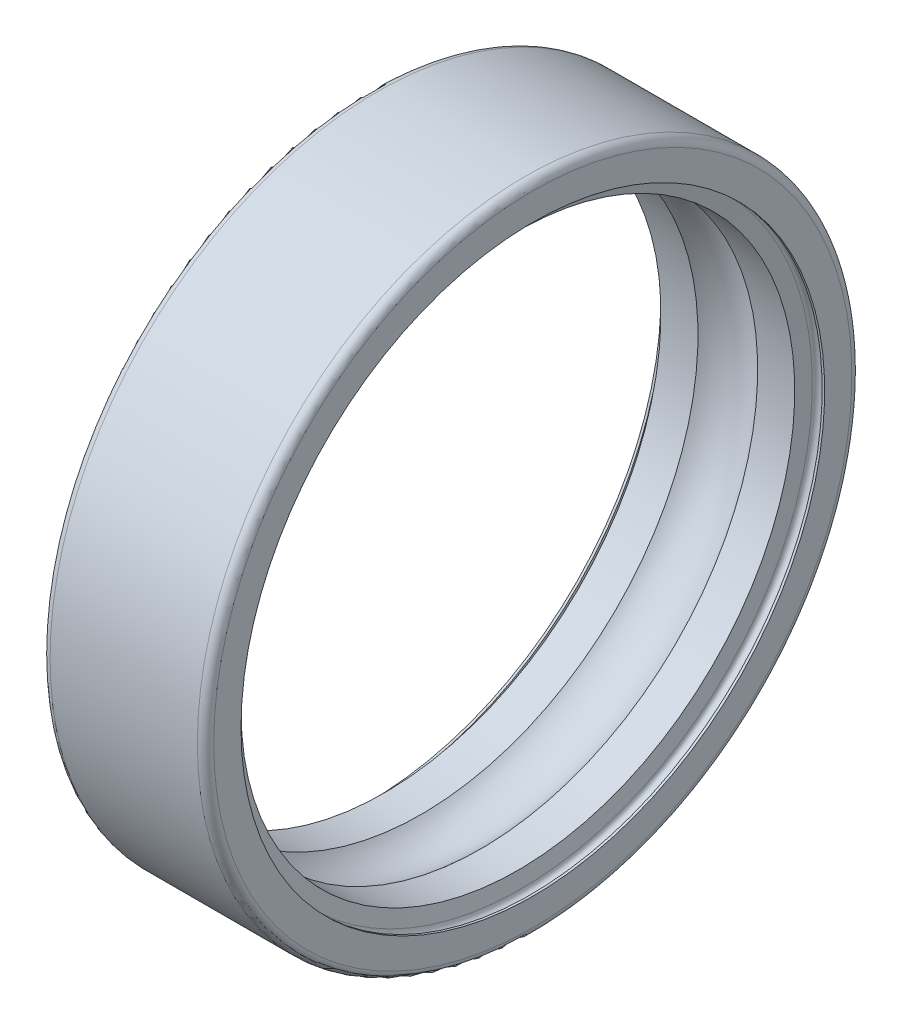
ISO-10303-21;
HEADER;
FILE_DESCRIPTION(('STEP AP214'),'2;1');
FILE_NAME('part.step','',(''),(''),'','','');
FILE_SCHEMA(('AUTOMOTIVE_DESIGN { 1 0 10303 214 1 1 1 1 }'));
ENDSEC;
DATA;
#1=APPLICATION_CONTEXT('core data for automotive mechanical design processes');
#2=APPLICATION_PROTOCOL_DEFINITION('international standard','automotive_design',2000,#1);
#3=PRODUCT_CONTEXT('',#1,'mechanical');
#4=PRODUCT('Part','Part','',(#3));
#5=PRODUCT_RELATED_PRODUCT_CATEGORY('part','',(#4));
#6=PRODUCT_DEFINITION_FORMATION('','',#4);
#7=PRODUCT_DEFINITION_CONTEXT('part definition',#1,'design');
#8=PRODUCT_DEFINITION('design','',#6,#7);
#9=PRODUCT_DEFINITION_SHAPE('','',#8);
#10=(LENGTH_UNIT() NAMED_UNIT(*) SI_UNIT(.MILLI.,.METRE.));
#11=(NAMED_UNIT(*) PLANE_ANGLE_UNIT() SI_UNIT($,.RADIAN.));
#12=(NAMED_UNIT(*) SI_UNIT($,.STERADIAN.) SOLID_ANGLE_UNIT());
#13=UNCERTAINTY_MEASURE_WITH_UNIT(LENGTH_MEASURE(1.E-05),#10,'distance_accuracy_value','');
#14=(GEOMETRIC_REPRESENTATION_CONTEXT(3) GLOBAL_UNCERTAINTY_ASSIGNED_CONTEXT((#13)) GLOBAL_UNIT_ASSIGNED_CONTEXT((#10,
#11,#12)) REPRESENTATION_CONTEXT('',''));
#15=CARTESIAN_POINT('',(0.,0.,0.));
#16=DIRECTION('',(0.,0.,1.));
#17=DIRECTION('',(1.,0.,0.));
#18=AXIS2_PLACEMENT_3D('',#15,#16,#17);
#19=CARTESIAN_POINT('',(0.,11.7,0.));
#20=DIRECTION('',(1.,0.,0.));
#21=DIRECTION('',(0.,0.,-1.));
#22=AXIS2_PLACEMENT_3D('',#19,#20,#21);
#23=PLANE('',#22);
#24=CARTESIAN_POINT('',(0.,0.,0.));
#25=DIRECTION('',(-1.,0.,0.));
#26=DIRECTION('',(0.,0.,1.));
#27=AXIS2_PLACEMENT_3D('',#24,#25,#26);
#28=CIRCLE('',#27,10.7);
#29=CARTESIAN_POINT('',(0.,0.,10.7));
#30=VERTEX_POINT('',#29);
#31=EDGE_CURVE('E77',#30,#30,#28,.T.);
#32=ORIENTED_EDGE('',*,*,#31,.F.);
#33=EDGE_LOOP('',(#32));
#34=FACE_BOUND('',#33,.T.);
#35=CARTESIAN_POINT('',(0.,0.,0.));
#36=DIRECTION('',(-1.,0.,0.));
#37=DIRECTION('',(0.,0.,1.));
#38=AXIS2_PLACEMENT_3D('',#35,#36,#37);
#39=CIRCLE('',#38,11.7);
#40=CARTESIAN_POINT('',(0.,0.,11.7));
#41=VERTEX_POINT('',#40);
#42=EDGE_CURVE('E10',#41,#41,#39,.T.);
#43=ORIENTED_EDGE('',*,*,#42,.T.);
#44=EDGE_LOOP('',(#43));
#45=FACE_BOUND('',#44,.T.);
#46=ADVANCED_FACE('F31',(#34,#45),#23,.F.);
#47=CARTESIAN_POINT('',(0.299999999999941,0.,0.));
#48=DIRECTION('',(-1.,0.,0.));
#49=DIRECTION('',(0.,0.,1.));
#50=AXIS2_PLACEMENT_3D('',#47,#48,#49);
#51=TOROIDAL_SURFACE('',#50,11.7000000000001,0.299999999999942);
#52=ORIENTED_EDGE('',*,*,#42,.F.);
#53=EDGE_LOOP('',(#52));
#54=FACE_BOUND('',#53,.T.);
#55=CARTESIAN_POINT('',(0.300000000000002,0.,0.));
#56=DIRECTION('',(-1.,0.,0.));
#57=DIRECTION('',(0.,0.,1.));
#58=AXIS2_PLACEMENT_3D('',#55,#56,#57);
#59=CIRCLE('',#58,12.);
#60=CARTESIAN_POINT('',(0.300000000000002,0.,12.));
#61=VERTEX_POINT('',#60);
#62=EDGE_CURVE('E37',#61,#61,#59,.T.);
#63=ORIENTED_EDGE('',*,*,#62,.T.);
#64=EDGE_LOOP('',(#63));
#65=FACE_BOUND('',#64,.T.);
#66=ADVANCED_FACE('F84',(#54,#65),#51,.T.);
#67=CARTESIAN_POINT('',(50.,0.,0.));
#68=DIRECTION('',(-1.,0.,0.));
#69=DIRECTION('',(0.,0.,1.));
#70=AXIS2_PLACEMENT_3D('',#67,#68,#69);
#71=CYLINDRICAL_SURFACE('',#70,12.);
#72=ORIENTED_EDGE('',*,*,#62,.F.);
#73=EDGE_LOOP('',(#72));
#74=FACE_BOUND('',#73,.T.);
#75=CARTESIAN_POINT('',(5.7,0.,0.));
#76=DIRECTION('',(-1.,0.,0.));
#77=DIRECTION('',(0.,0.,1.));
#78=AXIS2_PLACEMENT_3D('',#75,#76,#77);
#79=CIRCLE('',#78,12.);
#80=CARTESIAN_POINT('',(5.7,0.,12.));
#81=VERTEX_POINT('',#80);
#82=EDGE_CURVE('E41',#81,#81,#79,.T.);
#83=ORIENTED_EDGE('',*,*,#82,.T.);
#84=EDGE_LOOP('',(#83));
#85=FACE_BOUND('',#84,.T.);
#86=ADVANCED_FACE('F88',(#74,#85),#71,.T.);
#87=CARTESIAN_POINT('',(5.70000000000012,0.,0.));
#88=DIRECTION('',(-1.,0.,0.));
#89=DIRECTION('',(0.,0.,1.));
#90=AXIS2_PLACEMENT_3D('',#87,#88,#89);
#91=TOROIDAL_SURFACE('',#90,11.7000000000001,0.299999999999879);
#92=ORIENTED_EDGE('',*,*,#82,.F.);
#93=EDGE_LOOP('',(#92));
#94=FACE_BOUND('',#93,.T.);
#95=CARTESIAN_POINT('',(6.,0.,0.));
#96=DIRECTION('',(-1.,0.,0.));
#97=DIRECTION('',(0.,0.,1.));
#98=AXIS2_PLACEMENT_3D('',#95,#96,#97);
#99=CIRCLE('',#98,11.7);
#100=CARTESIAN_POINT('',(6.,0.,11.7));
#101=VERTEX_POINT('',#100);
#102=EDGE_CURVE('E45',#101,#101,#99,.T.);
#103=ORIENTED_EDGE('',*,*,#102,.T.);
#104=EDGE_LOOP('',(#103));
#105=FACE_BOUND('',#104,.T.);
#106=ADVANCED_FACE('F93',(#94,#105),#91,.T.);
#107=CARTESIAN_POINT('',(6.,10.7,0.));
#108=DIRECTION('',(-1.,0.,0.));
#109=DIRECTION('',(0.,0.,1.));
#110=AXIS2_PLACEMENT_3D('',#107,#108,#109);
#111=PLANE('',#110);
#112=ORIENTED_EDGE('',*,*,#102,.F.);
#113=EDGE_LOOP('',(#112));
#114=FACE_BOUND('',#113,.T.);
#115=CARTESIAN_POINT('',(6.,0.,0.));
#116=DIRECTION('',(-1.,0.,0.));
#117=DIRECTION('',(0.,0.,1.));
#118=AXIS2_PLACEMENT_3D('',#115,#116,#117);
#119=CIRCLE('',#118,10.7);
#120=CARTESIAN_POINT('',(6.,0.,10.7));
#121=VERTEX_POINT('',#120);
#122=EDGE_CURVE('E50',#121,#121,#119,.T.);
#123=ORIENTED_EDGE('',*,*,#122,.T.);
#124=EDGE_LOOP('',(#123));
#125=FACE_BOUND('',#124,.T.);
#126=ADVANCED_FACE('F99',(#114,#125),#111,.F.);
#127=CARTESIAN_POINT('',(50.,0.,0.));
#128=DIRECTION('',(-1.,0.,0.));
#129=DIRECTION('',(0.,0.,1.));
#130=AXIS2_PLACEMENT_3D('',#127,#128,#129);
#131=CYLINDRICAL_SURFACE('',#130,10.7);
#132=ORIENTED_EDGE('',*,*,#122,.F.);
#133=EDGE_LOOP('',(#132));
#134=FACE_BOUND('',#133,.T.);
#135=CARTESIAN_POINT('',(5.91,0.,0.));
#136=DIRECTION('',(-1.,0.,0.));
#137=DIRECTION('',(0.,0.,1.));
#138=AXIS2_PLACEMENT_3D('',#135,#136,#137);
#139=CIRCLE('',#138,10.7);
#140=CARTESIAN_POINT('',(5.91,0.,10.7));
#141=VERTEX_POINT('',#140);
#142=EDGE_CURVE('E53',#141,#141,#139,.T.);
#143=ORIENTED_EDGE('',*,*,#142,.T.);
#144=EDGE_LOOP('',(#143));
#145=FACE_BOUND('',#144,.T.);
#146=ADVANCED_FACE('F103',(#134,#145),#131,.F.);
#147=CARTESIAN_POINT('',(5.73,0.,0.));
#148=DIRECTION('',(-1.,0.,0.));
#149=DIRECTION('',(0.,0.,1.));
#150=AXIS2_PLACEMENT_3D('',#147,#148,#149);
#151=TOROIDAL_SURFACE('',#150,10.7,0.18);
#152=ORIENTED_EDGE('',*,*,#142,.F.);
#153=EDGE_LOOP('',(#152));
#154=FACE_BOUND('',#153,.T.);
#155=CARTESIAN_POINT('',(5.55,0.,0.));
#156=DIRECTION('',(-1.,0.,0.));
#157=DIRECTION('',(0.,0.,1.));
#158=AXIS2_PLACEMENT_3D('',#155,#156,#157);
#159=CIRCLE('',#158,10.7);
#160=CARTESIAN_POINT('',(5.55,0.,10.7));
#161=VERTEX_POINT('',#160);
#162=EDGE_CURVE('E56',#161,#161,#159,.T.);
#163=ORIENTED_EDGE('',*,*,#162,.T.);
#164=EDGE_LOOP('',(#163));
#165=FACE_BOUND('',#164,.T.);
#166=ADVANCED_FACE('F107',(#154,#165),#151,.F.);
#167=CARTESIAN_POINT('',(5.4530201606103,0.,0.));
#168=DIRECTION('',(1.,0.,0.));
#169=DIRECTION('',(0.,0.,-1.));
#170=AXIS2_PLACEMENT_3D('',#167,#168,#169);
#171=CONICAL_SURFACE('',#170,10.15,1.39626340159538);
#172=ORIENTED_EDGE('',*,*,#162,.F.);
#173=EDGE_LOOP('',(#172));
#174=FACE_BOUND('',#173,.T.);
#175=CARTESIAN_POINT('',(5.4530201606103,0.,0.));
#176=DIRECTION('',(-1.,0.,0.));
#177=DIRECTION('',(0.,0.,1.));
#178=AXIS2_PLACEMENT_3D('',#175,#176,#177);
#179=CIRCLE('',#178,10.15);
#180=CARTESIAN_POINT('',(5.4530201606103,0.,10.15));
#181=VERTEX_POINT('',#180);
#182=EDGE_CURVE('E59',#181,#181,#179,.T.);
#183=ORIENTED_EDGE('',*,*,#182,.T.);
#184=EDGE_LOOP('',(#183));
#185=FACE_BOUND('',#184,.T.);
#186=ADVANCED_FACE('F111',(#174,#185),#171,.F.);
#187=CARTESIAN_POINT('',(50.,0.,0.));
#188=DIRECTION('',(-1.,0.,0.));
#189=DIRECTION('',(0.,0.,1.));
#190=AXIS2_PLACEMENT_3D('',#187,#188,#189);
#191=CYLINDRICAL_SURFACE('',#190,10.15);
#192=ORIENTED_EDGE('',*,*,#182,.F.);
#193=EDGE_LOOP('',(#192));
#194=FACE_BOUND('',#193,.T.);
#195=CARTESIAN_POINT('',(4.0943748215305,0.,0.));
#196=DIRECTION('',(-1.,0.,0.));
#197=DIRECTION('',(0.,0.,1.));
#198=AXIS2_PLACEMENT_3D('',#195,#196,#197);
#199=CIRCLE('',#198,10.15);
#200=CARTESIAN_POINT('',(4.0943748215305,0.,10.15));
#201=VERTEX_POINT('',#200);
#202=EDGE_CURVE('E62',#201,#201,#199,.T.);
#203=ORIENTED_EDGE('',*,*,#202,.T.);
#204=EDGE_LOOP('',(#203));
#205=FACE_BOUND('',#204,.T.);
#206=ADVANCED_FACE('F115',(#194,#205),#191,.F.);
#207=CARTESIAN_POINT('',(3.,0.,0.));
#208=DIRECTION('',(-1.,0.,0.));
#209=DIRECTION('',(0.,0.,1.));
#210=AXIS2_PLACEMENT_3D('',#207,#208,#209);
#211=TOROIDAL_SURFACE('',#210,9.0000000000001,1.5874999999999);
#212=ORIENTED_EDGE('',*,*,#202,.F.);
#213=EDGE_LOOP('',(#212));
#214=FACE_BOUND('',#213,.T.);
#215=CARTESIAN_POINT('',(1.9056251784695,0.,0.));
#216=DIRECTION('',(-1.,0.,0.));
#217=DIRECTION('',(0.,0.,1.));
#218=AXIS2_PLACEMENT_3D('',#215,#216,#217);
#219=CIRCLE('',#218,10.15);
#220=CARTESIAN_POINT('',(1.9056251784695,0.,10.15));
#221=VERTEX_POINT('',#220);
#222=EDGE_CURVE('E65',#221,#221,#219,.T.);
#223=ORIENTED_EDGE('',*,*,#222,.T.);
#224=EDGE_LOOP('',(#223));
#225=FACE_BOUND('',#224,.T.);
#226=ADVANCED_FACE('F119',(#214,#225),#211,.F.);
#227=CARTESIAN_POINT('',(50.,0.,0.));
#228=DIRECTION('',(-1.,0.,0.));
#229=DIRECTION('',(0.,0.,1.));
#230=AXIS2_PLACEMENT_3D('',#227,#228,#229);
#231=CYLINDRICAL_SURFACE('',#230,10.15);
#232=ORIENTED_EDGE('',*,*,#222,.F.);
#233=EDGE_LOOP('',(#232));
#234=FACE_BOUND('',#233,.T.);
#235=CARTESIAN_POINT('',(0.546979839389651,0.,0.));
#236=DIRECTION('',(-1.,0.,0.));
#237=DIRECTION('',(0.,0.,1.));
#238=AXIS2_PLACEMENT_3D('',#235,#236,#237);
#239=CIRCLE('',#238,10.15);
#240=CARTESIAN_POINT('',(0.546979839389651,0.,10.15));
#241=VERTEX_POINT('',#240);
#242=EDGE_CURVE('E68',#241,#241,#239,.T.);
#243=ORIENTED_EDGE('',*,*,#242,.T.);
#244=EDGE_LOOP('',(#243));
#245=FACE_BOUND('',#244,.T.);
#246=ADVANCED_FACE('F123',(#234,#245),#231,.F.);
#247=CARTESIAN_POINT('',(0.449999999999999,0.,0.));
#248=DIRECTION('',(-1.,0.,0.));
#249=DIRECTION('',(0.,0.,1.));
#250=AXIS2_PLACEMENT_3D('',#247,#248,#249);
#251=CONICAL_SURFACE('',#250,10.7,1.39626340159547);
#252=ORIENTED_EDGE('',*,*,#242,.F.);
#253=EDGE_LOOP('',(#252));
#254=FACE_BOUND('',#253,.T.);
#255=CARTESIAN_POINT('',(0.449999999999999,0.,0.));
#256=DIRECTION('',(-1.,0.,0.));
#257=DIRECTION('',(0.,0.,1.));
#258=AXIS2_PLACEMENT_3D('',#255,#256,#257);
#259=CIRCLE('',#258,10.7);
#260=CARTESIAN_POINT('',(0.449999999999999,0.,10.7));
#261=VERTEX_POINT('',#260);
#262=EDGE_CURVE('E71',#261,#261,#259,.T.);
#263=ORIENTED_EDGE('',*,*,#262,.T.);
#264=EDGE_LOOP('',(#263));
#265=FACE_BOUND('',#264,.T.);
#266=ADVANCED_FACE('F127',(#254,#265),#251,.F.);
#267=CARTESIAN_POINT('',(0.27,0.,0.));
#268=DIRECTION('',(-1.,0.,0.));
#269=DIRECTION('',(0.,0.,1.));
#270=AXIS2_PLACEMENT_3D('',#267,#268,#269);
#271=TOROIDAL_SURFACE('',#270,10.7,0.18);
#272=ORIENTED_EDGE('',*,*,#262,.F.);
#273=EDGE_LOOP('',(#272));
#274=FACE_BOUND('',#273,.T.);
#275=CARTESIAN_POINT('',(0.0899999999999998,0.,0.));
#276=DIRECTION('',(-1.,0.,0.));
#277=DIRECTION('',(0.,0.,1.));
#278=AXIS2_PLACEMENT_3D('',#275,#276,#277);
#279=CIRCLE('',#278,10.7);
#280=CARTESIAN_POINT('',(0.0899999999999998,0.,10.7));
#281=VERTEX_POINT('',#280);
#282=EDGE_CURVE('E74',#281,#281,#279,.T.);
#283=ORIENTED_EDGE('',*,*,#282,.T.);
#284=EDGE_LOOP('',(#283));
#285=FACE_BOUND('',#284,.T.);
#286=ADVANCED_FACE('F131',(#274,#285),#271,.F.);
#287=CARTESIAN_POINT('',(50.,0.,0.));
#288=DIRECTION('',(-1.,0.,0.));
#289=DIRECTION('',(0.,0.,1.));
#290=AXIS2_PLACEMENT_3D('',#287,#288,#289);
#291=CYLINDRICAL_SURFACE('',#290,10.7);
#292=ORIENTED_EDGE('',*,*,#282,.F.);
#293=EDGE_LOOP('',(#292));
#294=FACE_BOUND('',#293,.T.);
#295=ORIENTED_EDGE('',*,*,#31,.T.);
#296=EDGE_LOOP('',(#295));
#297=FACE_BOUND('',#296,.T.);
#298=ADVANCED_FACE('F81',(#294,#297),#291,.F.);
#299=CLOSED_SHELL('',(#46,#66,#86,#106,#126,#146,#166,#186,#206,#226,#246,#266,#286,#298));
#300=MANIFOLD_SOLID_BREP('B2',#299);
#301=ADVANCED_BREP_SHAPE_REPRESENTATION('',(#18,#300),#14);
#302=SHAPE_DEFINITION_REPRESENTATION(#9,#301);
ENDSEC;
END-ISO-10303-21;
